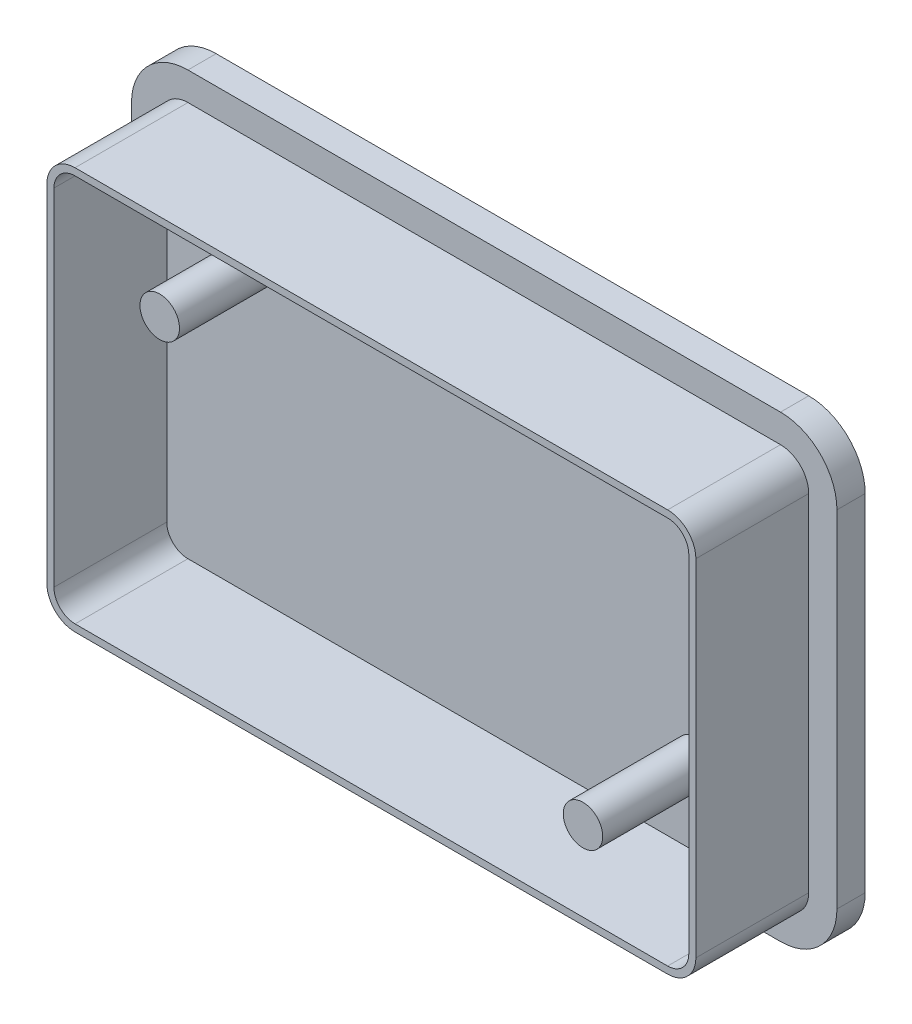
ISO-10303-21;
HEADER;
FILE_DESCRIPTION(('STEP AP214'),'2;1');
FILE_NAME('part.step','',(''),(''),'','','');
FILE_SCHEMA(('AUTOMOTIVE_DESIGN { 1 0 10303 214 1 1 1 1 }'));
ENDSEC;
DATA;
#1=APPLICATION_CONTEXT('core data for automotive mechanical design processes');
#2=APPLICATION_PROTOCOL_DEFINITION('international standard','automotive_design',2000,#1);
#3=PRODUCT_CONTEXT('',#1,'mechanical');
#4=PRODUCT('Part','Part','',(#3));
#5=PRODUCT_RELATED_PRODUCT_CATEGORY('part','',(#4));
#6=PRODUCT_DEFINITION_FORMATION('','',#4);
#7=PRODUCT_DEFINITION_CONTEXT('part definition',#1,'design');
#8=PRODUCT_DEFINITION('design','',#6,#7);
#9=PRODUCT_DEFINITION_SHAPE('','',#8);
#10=(LENGTH_UNIT() NAMED_UNIT(*) SI_UNIT(.MILLI.,.METRE.));
#11=(NAMED_UNIT(*) PLANE_ANGLE_UNIT() SI_UNIT($,.RADIAN.));
#12=(NAMED_UNIT(*) SI_UNIT($,.STERADIAN.) SOLID_ANGLE_UNIT());
#13=UNCERTAINTY_MEASURE_WITH_UNIT(LENGTH_MEASURE(1.E-05),#10,'distance_accuracy_value','');
#14=(GEOMETRIC_REPRESENTATION_CONTEXT(3) GLOBAL_UNCERTAINTY_ASSIGNED_CONTEXT((#13)) GLOBAL_UNIT_ASSIGNED_CONTEXT((#10,
#11,#12)) REPRESENTATION_CONTEXT('',''));
#15=CARTESIAN_POINT('',(0.,0.,0.));
#16=DIRECTION('',(0.,0.,1.));
#17=DIRECTION('',(1.,0.,0.));
#18=AXIS2_PLACEMENT_3D('',#15,#16,#17);
#19=CARTESIAN_POINT('',(-21.,12.25,2.));
#20=DIRECTION('',(0.,0.,-1.));
#21=DIRECTION('',(-1.,0.,0.));
#22=AXIS2_PLACEMENT_3D('',#19,#20,#21);
#23=CYLINDRICAL_SURFACE('',#22,4.);
#24=CARTESIAN_POINT('',(-21.,12.25,0.));
#25=DIRECTION('',(0.,0.,1.));
#26=DIRECTION('',(1.,0.,0.));
#27=AXIS2_PLACEMENT_3D('',#24,#25,#26);
#28=CIRCLE('',#27,4.);
#29=CARTESIAN_POINT('',(-25.,12.25,0.));
#30=VERTEX_POINT('',#29);
#31=CARTESIAN_POINT('',(-21.,16.25,0.));
#32=VERTEX_POINT('',#31);
#33=EDGE_CURVE('E453',#30,#32,#28,.F.);
#34=ORIENTED_EDGE('',*,*,#33,.F.);
#35=DIRECTION('',(0.,0.,-1.));
#36=VECTOR('',#35,1.);
#37=CARTESIAN_POINT('',(-25.,12.25,2.));
#38=LINE('',#37,#36);
#39=CARTESIAN_POINT('',(-25.,12.25,2.));
#40=VERTEX_POINT('',#39);
#41=EDGE_CURVE('E12',#40,#30,#38,.T.);
#42=ORIENTED_EDGE('',*,*,#41,.F.);
#43=CARTESIAN_POINT('',(-21.,12.25,2.));
#44=DIRECTION('',(0.,0.,1.));
#45=DIRECTION('',(1.,0.,0.));
#46=AXIS2_PLACEMENT_3D('',#43,#44,#45);
#47=CIRCLE('',#46,4.);
#48=CARTESIAN_POINT('',(-21.,16.25,2.));
#49=VERTEX_POINT('',#48);
#50=EDGE_CURVE('E454',#40,#49,#47,.F.);
#51=ORIENTED_EDGE('',*,*,#50,.T.);
#52=DIRECTION('',(0.,0.,-1.));
#53=VECTOR('',#52,1.);
#54=CARTESIAN_POINT('',(-21.,16.25,2.));
#55=LINE('',#54,#53);
#56=EDGE_CURVE('E484',#49,#32,#55,.T.);
#57=ORIENTED_EDGE('',*,*,#56,.T.);
#58=EDGE_LOOP('',(#34,#42,#51,#57));
#59=FACE_BOUND('',#58,.T.);
#60=ADVANCED_FACE('F94',(#59),#23,.T.);
#61=CARTESIAN_POINT('',(-25.,0.,2.));
#62=DIRECTION('',(-1.,0.,0.));
#63=DIRECTION('',(0.,0.,1.));
#64=AXIS2_PLACEMENT_3D('',#61,#62,#63);
#65=PLANE('',#64);
#66=DIRECTION('',(0.,1.,0.));
#67=VECTOR('',#66,1.);
#68=CARTESIAN_POINT('',(-25.,0.,0.));
#69=LINE('',#68,#67);
#70=CARTESIAN_POINT('',(-25.,-12.25,0.));
#71=VERTEX_POINT('',#70);
#72=EDGE_CURVE('E488',#71,#30,#69,.T.);
#73=ORIENTED_EDGE('',*,*,#72,.F.);
#74=DIRECTION('',(0.,0.,-1.));
#75=VECTOR('',#74,1.);
#76=CARTESIAN_POINT('',(-25.,-12.25,2.));
#77=LINE('',#76,#75);
#78=CARTESIAN_POINT('',(-25.,-12.25,2.));
#79=VERTEX_POINT('',#78);
#80=EDGE_CURVE('E102',#79,#71,#77,.T.);
#81=ORIENTED_EDGE('',*,*,#80,.F.);
#82=DIRECTION('',(0.,1.,0.));
#83=VECTOR('',#82,1.);
#84=CARTESIAN_POINT('',(-25.,0.,2.));
#85=LINE('',#84,#83);
#86=EDGE_CURVE('E458',#79,#40,#85,.T.);
#87=ORIENTED_EDGE('',*,*,#86,.T.);
#88=ORIENTED_EDGE('',*,*,#41,.T.);
#89=EDGE_LOOP('',(#73,#81,#87,#88));
#90=FACE_BOUND('',#89,.T.);
#91=ADVANCED_FACE('F540',(#90),#65,.T.);
#92=CARTESIAN_POINT('',(-21.,-12.25,2.));
#93=DIRECTION('',(0.,0.,-1.));
#94=DIRECTION('',(-1.,0.,0.));
#95=AXIS2_PLACEMENT_3D('',#92,#93,#94);
#96=CYLINDRICAL_SURFACE('',#95,4.);
#97=CARTESIAN_POINT('',(-21.,-12.25,0.));
#98=DIRECTION('',(0.,0.,1.));
#99=DIRECTION('',(1.,0.,0.));
#100=AXIS2_PLACEMENT_3D('',#97,#98,#99);
#101=CIRCLE('',#100,4.);
#102=CARTESIAN_POINT('',(-21.,-16.25,0.));
#103=VERTEX_POINT('',#102);
#104=EDGE_CURVE('E492',#103,#71,#101,.F.);
#105=ORIENTED_EDGE('',*,*,#104,.F.);
#106=DIRECTION('',(0.,0.,-1.));
#107=VECTOR('',#106,1.);
#108=CARTESIAN_POINT('',(-21.,-16.25,2.));
#109=LINE('',#108,#107);
#110=CARTESIAN_POINT('',(-21.,-16.25,2.));
#111=VERTEX_POINT('',#110);
#112=EDGE_CURVE('E529',#111,#103,#109,.T.);
#113=ORIENTED_EDGE('',*,*,#112,.F.);
#114=CARTESIAN_POINT('',(-21.,-12.25,2.));
#115=DIRECTION('',(0.,0.,1.));
#116=DIRECTION('',(1.,0.,0.));
#117=AXIS2_PLACEMENT_3D('',#114,#115,#116);
#118=CIRCLE('',#117,4.);
#119=EDGE_CURVE('E463',#111,#79,#118,.F.);
#120=ORIENTED_EDGE('',*,*,#119,.T.);
#121=ORIENTED_EDGE('',*,*,#80,.T.);
#122=EDGE_LOOP('',(#105,#113,#120,#121));
#123=FACE_BOUND('',#122,.T.);
#124=ADVANCED_FACE('F536',(#123),#96,.T.);
#125=CARTESIAN_POINT('',(0.,-16.25,2.));
#126=DIRECTION('',(0.,1.,0.));
#127=DIRECTION('',(0.,0.,1.));
#128=AXIS2_PLACEMENT_3D('',#125,#126,#127);
#129=PLANE('',#128);
#130=DIRECTION('',(1.,0.,0.));
#131=VECTOR('',#130,1.);
#132=CARTESIAN_POINT('',(0.,-16.25,0.));
#133=LINE('',#132,#131);
#134=CARTESIAN_POINT('',(21.,-16.25,0.));
#135=VERTEX_POINT('',#134);
#136=EDGE_CURVE('E496',#103,#135,#133,.T.);
#137=ORIENTED_EDGE('',*,*,#136,.T.);
#138=DIRECTION('',(0.,0.,-1.));
#139=VECTOR('',#138,1.);
#140=CARTESIAN_POINT('',(21.,-16.25,2.));
#141=LINE('',#140,#139);
#142=CARTESIAN_POINT('',(21.,-16.25,2.));
#143=VERTEX_POINT('',#142);
#144=EDGE_CURVE('E525',#143,#135,#141,.T.);
#145=ORIENTED_EDGE('',*,*,#144,.F.);
#146=DIRECTION('',(1.,0.,0.));
#147=VECTOR('',#146,1.);
#148=CARTESIAN_POINT('',(0.,-16.25,2.));
#149=LINE('',#148,#147);
#150=EDGE_CURVE('E467',#111,#143,#149,.T.);
#151=ORIENTED_EDGE('',*,*,#150,.F.);
#152=ORIENTED_EDGE('',*,*,#112,.T.);
#153=EDGE_LOOP('',(#137,#145,#151,#152));
#154=FACE_BOUND('',#153,.T.);
#155=ADVANCED_FACE('F549',(#154),#129,.F.);
#156=CARTESIAN_POINT('',(21.,-12.25,2.));
#157=DIRECTION('',(0.,0.,-1.));
#158=DIRECTION('',(-1.,0.,0.));
#159=AXIS2_PLACEMENT_3D('',#156,#157,#158);
#160=CYLINDRICAL_SURFACE('',#159,4.);
#161=CARTESIAN_POINT('',(21.,-12.25,0.));
#162=DIRECTION('',(0.,0.,1.));
#163=DIRECTION('',(1.,0.,0.));
#164=AXIS2_PLACEMENT_3D('',#161,#162,#163);
#165=CIRCLE('',#164,4.);
#166=CARTESIAN_POINT('',(25.,-12.25,0.));
#167=VERTEX_POINT('',#166);
#168=EDGE_CURVE('E499',#135,#167,#165,.T.);
#169=ORIENTED_EDGE('',*,*,#168,.T.);
#170=DIRECTION('',(0.,0.,-1.));
#171=VECTOR('',#170,1.);
#172=CARTESIAN_POINT('',(25.,-12.25,2.));
#173=LINE('',#172,#171);
#174=CARTESIAN_POINT('',(25.,-12.25,2.));
#175=VERTEX_POINT('',#174);
#176=EDGE_CURVE('E521',#175,#167,#173,.T.);
#177=ORIENTED_EDGE('',*,*,#176,.F.);
#178=CARTESIAN_POINT('',(21.,-12.25,2.));
#179=DIRECTION('',(0.,0.,1.));
#180=DIRECTION('',(1.,0.,0.));
#181=AXIS2_PLACEMENT_3D('',#178,#179,#180);
#182=CIRCLE('',#181,4.);
#183=EDGE_CURVE('E470',#143,#175,#182,.T.);
#184=ORIENTED_EDGE('',*,*,#183,.F.);
#185=ORIENTED_EDGE('',*,*,#144,.T.);
#186=EDGE_LOOP('',(#169,#177,#184,#185));
#187=FACE_BOUND('',#186,.T.);
#188=ADVANCED_FACE('F553',(#187),#160,.T.);
#189=CARTESIAN_POINT('',(25.,0.,2.));
#190=DIRECTION('',(-1.,0.,0.));
#191=DIRECTION('',(0.,0.,1.));
#192=AXIS2_PLACEMENT_3D('',#189,#190,#191);
#193=PLANE('',#192);
#194=DIRECTION('',(0.,1.,0.));
#195=VECTOR('',#194,1.);
#196=CARTESIAN_POINT('',(25.,0.,0.));
#197=LINE('',#196,#195);
#198=CARTESIAN_POINT('',(25.,12.25,0.));
#199=VERTEX_POINT('',#198);
#200=EDGE_CURVE('E502',#167,#199,#197,.T.);
#201=ORIENTED_EDGE('',*,*,#200,.T.);
#202=DIRECTION('',(0.,0.,-1.));
#203=VECTOR('',#202,1.);
#204=CARTESIAN_POINT('',(25.,12.25,2.));
#205=LINE('',#204,#203);
#206=CARTESIAN_POINT('',(25.,12.25,2.));
#207=VERTEX_POINT('',#206);
#208=EDGE_CURVE('E518',#207,#199,#205,.T.);
#209=ORIENTED_EDGE('',*,*,#208,.F.);
#210=DIRECTION('',(0.,1.,0.));
#211=VECTOR('',#210,1.);
#212=CARTESIAN_POINT('',(25.,0.,2.));
#213=LINE('',#212,#211);
#214=EDGE_CURVE('E473',#175,#207,#213,.T.);
#215=ORIENTED_EDGE('',*,*,#214,.F.);
#216=ORIENTED_EDGE('',*,*,#176,.T.);
#217=EDGE_LOOP('',(#201,#209,#215,#216));
#218=FACE_BOUND('',#217,.T.);
#219=ADVANCED_FACE('F570',(#218),#193,.F.);
#220=CARTESIAN_POINT('',(21.,12.25,2.));
#221=DIRECTION('',(0.,0.,-1.));
#222=DIRECTION('',(-1.,0.,0.));
#223=AXIS2_PLACEMENT_3D('',#220,#221,#222);
#224=CYLINDRICAL_SURFACE('',#223,4.);
#225=CARTESIAN_POINT('',(21.,12.25,0.));
#226=DIRECTION('',(0.,0.,1.));
#227=DIRECTION('',(1.,0.,0.));
#228=AXIS2_PLACEMENT_3D('',#225,#226,#227);
#229=CIRCLE('',#228,4.);
#230=CARTESIAN_POINT('',(21.,16.25,0.));
#231=VERTEX_POINT('',#230);
#232=EDGE_CURVE('E506',#231,#199,#229,.F.);
#233=ORIENTED_EDGE('',*,*,#232,.F.);
#234=DIRECTION('',(0.,0.,-1.));
#235=VECTOR('',#234,1.);
#236=CARTESIAN_POINT('',(21.,16.25,2.));
#237=LINE('',#236,#235);
#238=CARTESIAN_POINT('',(21.,16.25,2.));
#239=VERTEX_POINT('',#238);
#240=EDGE_CURVE('E515',#239,#231,#237,.T.);
#241=ORIENTED_EDGE('',*,*,#240,.F.);
#242=CARTESIAN_POINT('',(21.,12.25,2.));
#243=DIRECTION('',(0.,0.,1.));
#244=DIRECTION('',(1.,0.,0.));
#245=AXIS2_PLACEMENT_3D('',#242,#243,#244);
#246=CIRCLE('',#245,4.);
#247=EDGE_CURVE('E476',#239,#207,#246,.F.);
#248=ORIENTED_EDGE('',*,*,#247,.T.);
#249=ORIENTED_EDGE('',*,*,#208,.T.);
#250=EDGE_LOOP('',(#233,#241,#248,#249));
#251=FACE_BOUND('',#250,.T.);
#252=ADVANCED_FACE('F568',(#251),#224,.T.);
#253=CARTESIAN_POINT('',(0.,16.25,2.));
#254=DIRECTION('',(0.,1.,0.));
#255=DIRECTION('',(0.,0.,1.));
#256=AXIS2_PLACEMENT_3D('',#253,#254,#255);
#257=PLANE('',#256);
#258=DIRECTION('',(1.,0.,0.));
#259=VECTOR('',#258,1.);
#260=CARTESIAN_POINT('',(0.,16.25,0.));
#261=LINE('',#260,#259);
#262=EDGE_CURVE('E459',#32,#231,#261,.T.);
#263=ORIENTED_EDGE('',*,*,#262,.F.);
#264=ORIENTED_EDGE('',*,*,#56,.F.);
#265=DIRECTION('',(1.,0.,0.));
#266=VECTOR('',#265,1.);
#267=CARTESIAN_POINT('',(0.,16.25,2.));
#268=LINE('',#267,#266);
#269=EDGE_CURVE('E480',#49,#239,#268,.T.);
#270=ORIENTED_EDGE('',*,*,#269,.T.);
#271=ORIENTED_EDGE('',*,*,#240,.T.);
#272=EDGE_LOOP('',(#263,#264,#270,#271));
#273=FACE_BOUND('',#272,.T.);
#274=ADVANCED_FACE('F565',(#273),#257,.T.);
#275=CARTESIAN_POINT('',(0.,0.,2.));
#276=DIRECTION('',(0.,0.,1.));
#277=DIRECTION('',(1.,0.,0.));
#278=AXIS2_PLACEMENT_3D('',#275,#276,#277);
#279=PLANE('',#278);
#280=CARTESIAN_POINT('',(-21.,12.25,2.));
#281=DIRECTION('',(0.,0.,1.));
#282=DIRECTION('',(1.,0.,0.));
#283=AXIS2_PLACEMENT_3D('',#280,#281,#282);
#284=CIRCLE('',#283,2.);
#285=CARTESIAN_POINT('',(-21.,14.25,2.));
#286=VERTEX_POINT('',#285);
#287=CARTESIAN_POINT('',(-23.,12.25,2.));
#288=VERTEX_POINT('',#287);
#289=EDGE_CURVE('E258',#286,#288,#284,.T.);
#290=ORIENTED_EDGE('',*,*,#289,.F.);
#291=DIRECTION('',(-1.,0.,0.));
#292=VECTOR('',#291,1.);
#293=CARTESIAN_POINT('',(0.,14.25,2.));
#294=LINE('',#293,#292);
#295=CARTESIAN_POINT('',(21.,14.25,2.));
#296=VERTEX_POINT('',#295);
#297=EDGE_CURVE('E388',#296,#286,#294,.T.);
#298=ORIENTED_EDGE('',*,*,#297,.F.);
#299=CARTESIAN_POINT('',(21.,12.25,2.));
#300=DIRECTION('',(0.,0.,1.));
#301=DIRECTION('',(1.,0.,0.));
#302=AXIS2_PLACEMENT_3D('',#299,#300,#301);
#303=CIRCLE('',#302,2.);
#304=CARTESIAN_POINT('',(23.,12.25,2.));
#305=VERTEX_POINT('',#304);
#306=EDGE_CURVE('E392',#305,#296,#303,.T.);
#307=ORIENTED_EDGE('',*,*,#306,.F.);
#308=DIRECTION('',(0.,-1.,0.));
#309=VECTOR('',#308,1.);
#310=CARTESIAN_POINT('',(23.,0.,2.));
#311=LINE('',#310,#309);
#312=CARTESIAN_POINT('',(23.,-12.25,2.));
#313=VERTEX_POINT('',#312);
#314=EDGE_CURVE('E396',#305,#313,#311,.T.);
#315=ORIENTED_EDGE('',*,*,#314,.T.);
#316=CARTESIAN_POINT('',(21.,-12.25,2.));
#317=DIRECTION('',(0.,0.,1.));
#318=DIRECTION('',(1.,0.,0.));
#319=AXIS2_PLACEMENT_3D('',#316,#317,#318);
#320=CIRCLE('',#319,2.);
#321=CARTESIAN_POINT('',(21.,-14.25,2.));
#322=VERTEX_POINT('',#321);
#323=EDGE_CURVE('E399',#313,#322,#320,.F.);
#324=ORIENTED_EDGE('',*,*,#323,.T.);
#325=DIRECTION('',(-1.,0.,0.));
#326=VECTOR('',#325,1.);
#327=CARTESIAN_POINT('',(0.,-14.25,2.));
#328=LINE('',#327,#326);
#329=CARTESIAN_POINT('',(-21.,-14.25,2.));
#330=VERTEX_POINT('',#329);
#331=EDGE_CURVE('E402',#322,#330,#328,.T.);
#332=ORIENTED_EDGE('',*,*,#331,.T.);
#333=CARTESIAN_POINT('',(-21.,-12.25,2.));
#334=DIRECTION('',(0.,0.,1.));
#335=DIRECTION('',(1.,0.,0.));
#336=AXIS2_PLACEMENT_3D('',#333,#334,#335);
#337=CIRCLE('',#336,2.);
#338=CARTESIAN_POINT('',(-23.,-12.25,2.));
#339=VERTEX_POINT('',#338);
#340=EDGE_CURVE('E114',#339,#330,#337,.T.);
#341=ORIENTED_EDGE('',*,*,#340,.F.);
#342=DIRECTION('',(0.,-1.,0.));
#343=VECTOR('',#342,1.);
#344=CARTESIAN_POINT('',(-23.,0.,2.));
#345=LINE('',#344,#343);
#346=EDGE_CURVE('E109',#288,#339,#345,.T.);
#347=ORIENTED_EDGE('',*,*,#346,.F.);
#348=EDGE_LOOP('',(#290,#298,#307,#315,#324,#332,#341,#347));
#349=FACE_BOUND('',#348,.T.);
#350=ORIENTED_EDGE('',*,*,#50,.F.);
#351=ORIENTED_EDGE('',*,*,#86,.F.);
#352=ORIENTED_EDGE('',*,*,#119,.F.);
#353=ORIENTED_EDGE('',*,*,#150,.T.);
#354=ORIENTED_EDGE('',*,*,#183,.T.);
#355=ORIENTED_EDGE('',*,*,#214,.T.);
#356=ORIENTED_EDGE('',*,*,#247,.F.);
#357=ORIENTED_EDGE('',*,*,#269,.F.);
#358=EDGE_LOOP('',(#350,#351,#352,#353,#354,#355,#356,#357));
#359=FACE_BOUND('',#358,.T.);
#360=ADVANCED_FACE('F558',(#349,#359),#279,.T.);
#361=CARTESIAN_POINT('',(0.,0.,0.));
#362=DIRECTION('',(0.,0.,1.));
#363=DIRECTION('',(1.,0.,0.));
#364=AXIS2_PLACEMENT_3D('',#361,#362,#363);
#365=PLANE('',#364);
#366=ORIENTED_EDGE('',*,*,#33,.T.);
#367=ORIENTED_EDGE('',*,*,#262,.T.);
#368=ORIENTED_EDGE('',*,*,#232,.T.);
#369=ORIENTED_EDGE('',*,*,#200,.F.);
#370=ORIENTED_EDGE('',*,*,#168,.F.);
#371=ORIENTED_EDGE('',*,*,#136,.F.);
#372=ORIENTED_EDGE('',*,*,#104,.T.);
#373=ORIENTED_EDGE('',*,*,#72,.T.);
#374=EDGE_LOOP('',(#366,#367,#368,#369,#370,#371,#372,#373));
#375=FACE_BOUND('',#374,.T.);
#376=ADVANCED_FACE('F544',(#375),#365,.F.);
#377=CARTESIAN_POINT('',(-22.5,0.,10.));
#378=DIRECTION('',(-1.,0.,0.));
#379=DIRECTION('',(0.,0.,1.));
#380=AXIS2_PLACEMENT_3D('',#377,#378,#379);
#381=PLANE('',#380);
#382=DIRECTION('',(0.,-1.,0.));
#383=VECTOR('',#382,1.);
#384=CARTESIAN_POINT('',(-22.5,0.,2.));
#385=LINE('',#384,#383);
#386=CARTESIAN_POINT('',(-22.5,12.25,2.));
#387=VERTEX_POINT('',#386);
#388=CARTESIAN_POINT('',(-22.5,-12.25,2.));
#389=VERTEX_POINT('',#388);
#390=EDGE_CURVE('E433',#387,#389,#385,.T.);
#391=ORIENTED_EDGE('',*,*,#390,.F.);
#392=DIRECTION('',(0.,0.,-1.));
#393=VECTOR('',#392,1.);
#394=CARTESIAN_POINT('',(-22.5,12.25,10.));
#395=LINE('',#394,#393);
#396=CARTESIAN_POINT('',(-22.5,12.25,10.));
#397=VERTEX_POINT('',#396);
#398=EDGE_CURVE('E356',#397,#387,#395,.T.);
#399=ORIENTED_EDGE('',*,*,#398,.F.);
#400=DIRECTION('',(0.,1.,0.));
#401=VECTOR('',#400,1.);
#402=CARTESIAN_POINT('',(-22.5,0.,10.));
#403=LINE('',#402,#401);
#404=CARTESIAN_POINT('',(-22.5,-12.25,10.));
#405=VERTEX_POINT('',#404);
#406=EDGE_CURVE('E301',#405,#397,#403,.T.);
#407=ORIENTED_EDGE('',*,*,#406,.F.);
#408=DIRECTION('',(0.,0.,-1.));
#409=VECTOR('',#408,1.);
#410=CARTESIAN_POINT('',(-22.5,-12.25,10.));
#411=LINE('',#410,#409);
#412=EDGE_CURVE('E262',#405,#389,#411,.T.);
#413=ORIENTED_EDGE('',*,*,#412,.T.);
#414=EDGE_LOOP('',(#391,#399,#407,#413));
#415=FACE_BOUND('',#414,.T.);
#416=ADVANCED_FACE('F633',(#415),#381,.F.);
#417=CARTESIAN_POINT('',(-21.,12.25,10.));
#418=DIRECTION('',(0.,0.,-1.));
#419=DIRECTION('',(-1.,0.,0.));
#420=AXIS2_PLACEMENT_3D('',#417,#418,#419);
#421=CYLINDRICAL_SURFACE('',#420,1.5);
#422=CARTESIAN_POINT('',(-21.,12.25,2.));
#423=DIRECTION('',(0.,0.,1.));
#424=DIRECTION('',(1.,0.,0.));
#425=AXIS2_PLACEMENT_3D('',#422,#423,#424);
#426=CIRCLE('',#425,1.5);
#427=CARTESIAN_POINT('',(-21.,13.75,2.));
#428=VERTEX_POINT('',#427);
#429=EDGE_CURVE('E429',#428,#387,#426,.T.);
#430=ORIENTED_EDGE('',*,*,#429,.F.);
#431=DIRECTION('',(0.,0.,-1.));
#432=VECTOR('',#431,1.);
#433=CARTESIAN_POINT('',(-21.,13.75,10.));
#434=LINE('',#433,#432);
#435=CARTESIAN_POINT('',(-21.,13.75,10.));
#436=VERTEX_POINT('',#435);
#437=EDGE_CURVE('E352',#436,#428,#434,.T.);
#438=ORIENTED_EDGE('',*,*,#437,.F.);
#439=CARTESIAN_POINT('',(-21.,12.25,10.));
#440=DIRECTION('',(0.,0.,1.));
#441=DIRECTION('',(1.,0.,0.));
#442=AXIS2_PLACEMENT_3D('',#439,#440,#441);
#443=CIRCLE('',#442,1.5);
#444=EDGE_CURVE('E305',#397,#436,#443,.F.);
#445=ORIENTED_EDGE('',*,*,#444,.F.);
#446=ORIENTED_EDGE('',*,*,#398,.T.);
#447=EDGE_LOOP('',(#430,#438,#445,#446));
#448=FACE_BOUND('',#447,.T.);
#449=ADVANCED_FACE('F642',(#448),#421,.F.);
#450=CARTESIAN_POINT('',(0.,13.75,10.));
#451=DIRECTION('',(0.,1.,0.));
#452=DIRECTION('',(0.,0.,1.));
#453=AXIS2_PLACEMENT_3D('',#450,#451,#452);
#454=PLANE('',#453);
#455=DIRECTION('',(-1.,0.,0.));
#456=VECTOR('',#455,1.);
#457=CARTESIAN_POINT('',(0.,13.75,2.));
#458=LINE('',#457,#456);
#459=CARTESIAN_POINT('',(21.,13.75,2.));
#460=VERTEX_POINT('',#459);
#461=EDGE_CURVE('E425',#460,#428,#458,.T.);
#462=ORIENTED_EDGE('',*,*,#461,.F.);
#463=DIRECTION('',(0.,0.,-1.));
#464=VECTOR('',#463,1.);
#465=CARTESIAN_POINT('',(21.,13.75,10.));
#466=LINE('',#465,#464);
#467=CARTESIAN_POINT('',(21.,13.75,10.));
#468=VERTEX_POINT('',#467);
#469=EDGE_CURVE('E348',#468,#460,#466,.T.);
#470=ORIENTED_EDGE('',*,*,#469,.F.);
#471=DIRECTION('',(1.,0.,0.));
#472=VECTOR('',#471,1.);
#473=CARTESIAN_POINT('',(0.,13.75,10.));
#474=LINE('',#473,#472);
#475=EDGE_CURVE('E308',#436,#468,#474,.T.);
#476=ORIENTED_EDGE('',*,*,#475,.F.);
#477=ORIENTED_EDGE('',*,*,#437,.T.);
#478=EDGE_LOOP('',(#462,#470,#476,#477));
#479=FACE_BOUND('',#478,.T.);
#480=ADVANCED_FACE('F652',(#479),#454,.F.);
#481=CARTESIAN_POINT('',(21.,12.25,10.));
#482=DIRECTION('',(0.,0.,-1.));
#483=DIRECTION('',(-1.,0.,0.));
#484=AXIS2_PLACEMENT_3D('',#481,#482,#483);
#485=CYLINDRICAL_SURFACE('',#484,1.5);
#486=CARTESIAN_POINT('',(21.,12.25,2.));
#487=DIRECTION('',(0.,0.,1.));
#488=DIRECTION('',(1.,0.,0.));
#489=AXIS2_PLACEMENT_3D('',#486,#487,#488);
#490=CIRCLE('',#489,1.5);
#491=CARTESIAN_POINT('',(22.5,12.25,2.));
#492=VERTEX_POINT('',#491);
#493=EDGE_CURVE('E421',#492,#460,#490,.T.);
#494=ORIENTED_EDGE('',*,*,#493,.F.);
#495=DIRECTION('',(0.,0.,-1.));
#496=VECTOR('',#495,1.);
#497=CARTESIAN_POINT('',(22.5,12.25,10.));
#498=LINE('',#497,#496);
#499=CARTESIAN_POINT('',(22.5,12.25,10.));
#500=VERTEX_POINT('',#499);
#501=EDGE_CURVE('E344',#500,#492,#498,.T.);
#502=ORIENTED_EDGE('',*,*,#501,.F.);
#503=CARTESIAN_POINT('',(21.,12.25,10.));
#504=DIRECTION('',(0.,0.,1.));
#505=DIRECTION('',(1.,0.,0.));
#506=AXIS2_PLACEMENT_3D('',#503,#504,#505);
#507=CIRCLE('',#506,1.5);
#508=EDGE_CURVE('E311',#468,#500,#507,.F.);
#509=ORIENTED_EDGE('',*,*,#508,.F.);
#510=ORIENTED_EDGE('',*,*,#469,.T.);
#511=EDGE_LOOP('',(#494,#502,#509,#510));
#512=FACE_BOUND('',#511,.T.);
#513=ADVANCED_FACE('F662',(#512),#485,.F.);
#514=CARTESIAN_POINT('',(22.5,0.,10.));
#515=DIRECTION('',(-1.,0.,0.));
#516=DIRECTION('',(0.,0.,1.));
#517=AXIS2_PLACEMENT_3D('',#514,#515,#516);
#518=PLANE('',#517);
#519=ORIENTED_EDGE('',*,*,#501,.T.);
#520=DIRECTION('',(0.,-1.,0.));
#521=VECTOR('',#520,1.);
#522=CARTESIAN_POINT('',(22.5,0.,2.));
#523=LINE('',#522,#521);
#524=CARTESIAN_POINT('',(22.5,-12.25,2.));
#525=VERTEX_POINT('',#524);
#526=EDGE_CURVE('E418',#492,#525,#523,.T.);
#527=ORIENTED_EDGE('',*,*,#526,.T.);
#528=DIRECTION('',(0.,0.,-1.));
#529=VECTOR('',#528,1.);
#530=CARTESIAN_POINT('',(22.5,-12.25,10.));
#531=LINE('',#530,#529);
#532=CARTESIAN_POINT('',(22.5,-12.25,10.));
#533=VERTEX_POINT('',#532);
#534=EDGE_CURVE('E340',#533,#525,#531,.T.);
#535=ORIENTED_EDGE('',*,*,#534,.F.);
#536=DIRECTION('',(0.,1.,0.));
#537=VECTOR('',#536,1.);
#538=CARTESIAN_POINT('',(22.5,0.,10.));
#539=LINE('',#538,#537);
#540=EDGE_CURVE('E314',#533,#500,#539,.T.);
#541=ORIENTED_EDGE('',*,*,#540,.T.);
#542=EDGE_LOOP('',(#519,#527,#535,#541));
#543=FACE_BOUND('',#542,.T.);
#544=ADVANCED_FACE('F672',(#543),#518,.T.);
#545=CARTESIAN_POINT('',(21.,-12.25,10.));
#546=DIRECTION('',(0.,0.,-1.));
#547=DIRECTION('',(-1.,0.,0.));
#548=AXIS2_PLACEMENT_3D('',#545,#546,#547);
#549=CYLINDRICAL_SURFACE('',#548,1.5);
#550=ORIENTED_EDGE('',*,*,#534,.T.);
#551=CARTESIAN_POINT('',(21.,-12.25,2.));
#552=DIRECTION('',(0.,0.,1.));
#553=DIRECTION('',(1.,0.,0.));
#554=AXIS2_PLACEMENT_3D('',#551,#552,#553);
#555=CIRCLE('',#554,1.5);
#556=CARTESIAN_POINT('',(21.,-13.75,2.));
#557=VERTEX_POINT('',#556);
#558=EDGE_CURVE('E415',#525,#557,#555,.F.);
#559=ORIENTED_EDGE('',*,*,#558,.T.);
#560=DIRECTION('',(0.,0.,-1.));
#561=VECTOR('',#560,1.);
#562=CARTESIAN_POINT('',(21.,-13.75,10.));
#563=LINE('',#562,#561);
#564=CARTESIAN_POINT('',(21.,-13.75,10.));
#565=VERTEX_POINT('',#564);
#566=EDGE_CURVE('E336',#565,#557,#563,.T.);
#567=ORIENTED_EDGE('',*,*,#566,.F.);
#568=CARTESIAN_POINT('',(21.,-12.25,10.));
#569=DIRECTION('',(0.,0.,1.));
#570=DIRECTION('',(1.,0.,0.));
#571=AXIS2_PLACEMENT_3D('',#568,#569,#570);
#572=CIRCLE('',#571,1.5);
#573=EDGE_CURVE('E318',#565,#533,#572,.T.);
#574=ORIENTED_EDGE('',*,*,#573,.T.);
#575=EDGE_LOOP('',(#550,#559,#567,#574));
#576=FACE_BOUND('',#575,.T.);
#577=ADVANCED_FACE('F682',(#576),#549,.F.);
#578=CARTESIAN_POINT('',(0.,-13.75,10.));
#579=DIRECTION('',(0.,1.,0.));
#580=DIRECTION('',(0.,0.,1.));
#581=AXIS2_PLACEMENT_3D('',#578,#579,#580);
#582=PLANE('',#581);
#583=ORIENTED_EDGE('',*,*,#566,.T.);
#584=DIRECTION('',(-1.,0.,0.));
#585=VECTOR('',#584,1.);
#586=CARTESIAN_POINT('',(0.,-13.75,2.));
#587=LINE('',#586,#585);
#588=CARTESIAN_POINT('',(-21.,-13.75,2.));
#589=VERTEX_POINT('',#588);
#590=EDGE_CURVE('E411',#557,#589,#587,.T.);
#591=ORIENTED_EDGE('',*,*,#590,.T.);
#592=DIRECTION('',(0.,0.,-1.));
#593=VECTOR('',#592,1.);
#594=CARTESIAN_POINT('',(-21.,-13.75,10.));
#595=LINE('',#594,#593);
#596=CARTESIAN_POINT('',(-21.,-13.75,10.));
#597=VERTEX_POINT('',#596);
#598=EDGE_CURVE('E333',#597,#589,#595,.T.);
#599=ORIENTED_EDGE('',*,*,#598,.F.);
#600=DIRECTION('',(1.,0.,0.));
#601=VECTOR('',#600,1.);
#602=CARTESIAN_POINT('',(0.,-13.75,10.));
#603=LINE('',#602,#601);
#604=EDGE_CURVE('E322',#597,#565,#603,.T.);
#605=ORIENTED_EDGE('',*,*,#604,.T.);
#606=EDGE_LOOP('',(#583,#591,#599,#605));
#607=FACE_BOUND('',#606,.T.);
#608=ADVANCED_FACE('F692',(#607),#582,.T.);
#609=CARTESIAN_POINT('',(-21.,12.25,10.));
#610=DIRECTION('',(0.,0.,-1.));
#611=DIRECTION('',(-1.,0.,0.));
#612=AXIS2_PLACEMENT_3D('',#609,#610,#611);
#613=CYLINDRICAL_SURFACE('',#612,2.);
#614=DIRECTION('',(0.,0.,-1.));
#615=VECTOR('',#614,1.);
#616=CARTESIAN_POINT('',(-21.,14.25,10.));
#617=LINE('',#616,#615);
#618=CARTESIAN_POINT('',(-21.,14.25,10.));
#619=VERTEX_POINT('',#618);
#620=EDGE_CURVE('E329',#619,#286,#617,.T.);
#621=ORIENTED_EDGE('',*,*,#620,.T.);
#622=ORIENTED_EDGE('',*,*,#289,.T.);
#623=DIRECTION('',(0.,0.,-1.));
#624=VECTOR('',#623,1.);
#625=CARTESIAN_POINT('',(-23.,12.25,10.));
#626=LINE('',#625,#624);
#627=CARTESIAN_POINT('',(-23.,12.25,10.));
#628=VERTEX_POINT('',#627);
#629=EDGE_CURVE('E252',#628,#288,#626,.T.);
#630=ORIENTED_EDGE('',*,*,#629,.F.);
#631=CARTESIAN_POINT('',(-21.,12.25,10.));
#632=DIRECTION('',(0.,0.,1.));
#633=DIRECTION('',(1.,0.,0.));
#634=AXIS2_PLACEMENT_3D('',#631,#632,#633);
#635=CIRCLE('',#634,2.);
#636=EDGE_CURVE('E256',#628,#619,#635,.F.);
#637=ORIENTED_EDGE('',*,*,#636,.T.);
#638=EDGE_LOOP('',(#621,#622,#630,#637));
#639=FACE_BOUND('',#638,.T.);
#640=ADVANCED_FACE('F255',(#639),#613,.T.);
#641=CARTESIAN_POINT('',(-23.,0.,10.));
#642=DIRECTION('',(-1.,0.,0.));
#643=DIRECTION('',(0.,0.,1.));
#644=AXIS2_PLACEMENT_3D('',#641,#642,#643);
#645=PLANE('',#644);
#646=ORIENTED_EDGE('',*,*,#629,.T.);
#647=ORIENTED_EDGE('',*,*,#346,.T.);
#648=DIRECTION('',(0.,0.,-1.));
#649=VECTOR('',#648,1.);
#650=CARTESIAN_POINT('',(-23.,-12.25,10.));
#651=LINE('',#650,#649);
#652=CARTESIAN_POINT('',(-23.,-12.25,10.));
#653=VERTEX_POINT('',#652);
#654=EDGE_CURVE('E263',#653,#339,#651,.T.);
#655=ORIENTED_EDGE('',*,*,#654,.F.);
#656=DIRECTION('',(0.,1.,0.));
#657=VECTOR('',#656,1.);
#658=CARTESIAN_POINT('',(-23.,0.,10.));
#659=LINE('',#658,#657);
#660=EDGE_CURVE('E270',#653,#628,#659,.T.);
#661=ORIENTED_EDGE('',*,*,#660,.T.);
#662=EDGE_LOOP('',(#646,#647,#655,#661));
#663=FACE_BOUND('',#662,.T.);
#664=ADVANCED_FACE('F277',(#663),#645,.T.);
#665=CARTESIAN_POINT('',(-21.,-12.25,10.));
#666=DIRECTION('',(0.,0.,-1.));
#667=DIRECTION('',(-1.,0.,0.));
#668=AXIS2_PLACEMENT_3D('',#665,#666,#667);
#669=CYLINDRICAL_SURFACE('',#668,2.);
#670=ORIENTED_EDGE('',*,*,#654,.T.);
#671=ORIENTED_EDGE('',*,*,#340,.T.);
#672=DIRECTION('',(0.,0.,-1.));
#673=VECTOR('',#672,1.);
#674=CARTESIAN_POINT('',(-21.,-14.25,10.));
#675=LINE('',#674,#673);
#676=CARTESIAN_POINT('',(-21.,-14.25,10.));
#677=VERTEX_POINT('',#676);
#678=EDGE_CURVE('E379',#677,#330,#675,.T.);
#679=ORIENTED_EDGE('',*,*,#678,.F.);
#680=CARTESIAN_POINT('',(-21.,-12.25,10.));
#681=DIRECTION('',(0.,0.,1.));
#682=DIRECTION('',(1.,0.,0.));
#683=AXIS2_PLACEMENT_3D('',#680,#681,#682);
#684=CIRCLE('',#683,2.);
#685=EDGE_CURVE('E280',#677,#653,#684,.F.);
#686=ORIENTED_EDGE('',*,*,#685,.T.);
#687=EDGE_LOOP('',(#670,#671,#679,#686));
#688=FACE_BOUND('',#687,.T.);
#689=ADVANCED_FACE('F719',(#688),#669,.T.);
#690=CARTESIAN_POINT('',(0.,-14.25,10.));
#691=DIRECTION('',(0.,1.,0.));
#692=DIRECTION('',(0.,0.,1.));
#693=AXIS2_PLACEMENT_3D('',#690,#691,#692);
#694=PLANE('',#693);
#695=ORIENTED_EDGE('',*,*,#331,.F.);
#696=DIRECTION('',(0.,0.,-1.));
#697=VECTOR('',#696,1.);
#698=CARTESIAN_POINT('',(21.,-14.25,10.));
#699=LINE('',#698,#697);
#700=CARTESIAN_POINT('',(21.,-14.25,10.));
#701=VERTEX_POINT('',#700);
#702=EDGE_CURVE('E375',#701,#322,#699,.T.);
#703=ORIENTED_EDGE('',*,*,#702,.F.);
#704=DIRECTION('',(1.,0.,0.));
#705=VECTOR('',#704,1.);
#706=CARTESIAN_POINT('',(0.,-14.25,10.));
#707=LINE('',#706,#705);
#708=EDGE_CURVE('E284',#677,#701,#707,.T.);
#709=ORIENTED_EDGE('',*,*,#708,.F.);
#710=ORIENTED_EDGE('',*,*,#678,.T.);
#711=EDGE_LOOP('',(#695,#703,#709,#710));
#712=FACE_BOUND('',#711,.T.);
#713=ADVANCED_FACE('F728',(#712),#694,.F.);
#714=CARTESIAN_POINT('',(21.,-12.25,10.));
#715=DIRECTION('',(0.,0.,-1.));
#716=DIRECTION('',(-1.,0.,0.));
#717=AXIS2_PLACEMENT_3D('',#714,#715,#716);
#718=CYLINDRICAL_SURFACE('',#717,2.);
#719=ORIENTED_EDGE('',*,*,#323,.F.);
#720=DIRECTION('',(0.,0.,-1.));
#721=VECTOR('',#720,1.);
#722=CARTESIAN_POINT('',(23.,-12.25,10.));
#723=LINE('',#722,#721);
#724=CARTESIAN_POINT('',(23.,-12.25,10.));
#725=VERTEX_POINT('',#724);
#726=EDGE_CURVE('E371',#725,#313,#723,.T.);
#727=ORIENTED_EDGE('',*,*,#726,.F.);
#728=CARTESIAN_POINT('',(21.,-12.25,10.));
#729=DIRECTION('',(0.,0.,1.));
#730=DIRECTION('',(1.,0.,0.));
#731=AXIS2_PLACEMENT_3D('',#728,#729,#730);
#732=CIRCLE('',#731,2.);
#733=EDGE_CURVE('E289',#701,#725,#732,.T.);
#734=ORIENTED_EDGE('',*,*,#733,.F.);
#735=ORIENTED_EDGE('',*,*,#702,.T.);
#736=EDGE_LOOP('',(#719,#727,#734,#735));
#737=FACE_BOUND('',#736,.T.);
#738=ADVANCED_FACE('F738',(#737),#718,.T.);
#739=CARTESIAN_POINT('',(23.,0.,10.));
#740=DIRECTION('',(-1.,0.,0.));
#741=DIRECTION('',(0.,0.,1.));
#742=AXIS2_PLACEMENT_3D('',#739,#740,#741);
#743=PLANE('',#742);
#744=ORIENTED_EDGE('',*,*,#314,.F.);
#745=DIRECTION('',(0.,0.,-1.));
#746=VECTOR('',#745,1.);
#747=CARTESIAN_POINT('',(23.,12.25,10.));
#748=LINE('',#747,#746);
#749=CARTESIAN_POINT('',(23.,12.25,10.));
#750=VERTEX_POINT('',#749);
#751=EDGE_CURVE('E367',#750,#305,#748,.T.);
#752=ORIENTED_EDGE('',*,*,#751,.F.);
#753=DIRECTION('',(0.,1.,0.));
#754=VECTOR('',#753,1.);
#755=CARTESIAN_POINT('',(23.,0.,10.));
#756=LINE('',#755,#754);
#757=EDGE_CURVE('E292',#725,#750,#756,.T.);
#758=ORIENTED_EDGE('',*,*,#757,.F.);
#759=ORIENTED_EDGE('',*,*,#726,.T.);
#760=EDGE_LOOP('',(#744,#752,#758,#759));
#761=FACE_BOUND('',#760,.T.);
#762=ADVANCED_FACE('F748',(#761),#743,.F.);
#763=CARTESIAN_POINT('',(21.,12.25,10.));
#764=DIRECTION('',(0.,0.,-1.));
#765=DIRECTION('',(-1.,0.,0.));
#766=AXIS2_PLACEMENT_3D('',#763,#764,#765);
#767=CYLINDRICAL_SURFACE('',#766,2.);
#768=ORIENTED_EDGE('',*,*,#751,.T.);
#769=ORIENTED_EDGE('',*,*,#306,.T.);
#770=DIRECTION('',(0.,0.,-1.));
#771=VECTOR('',#770,1.);
#772=CARTESIAN_POINT('',(21.,14.25,10.));
#773=LINE('',#772,#771);
#774=CARTESIAN_POINT('',(21.,14.25,10.));
#775=VERTEX_POINT('',#774);
#776=EDGE_CURVE('E363',#775,#296,#773,.T.);
#777=ORIENTED_EDGE('',*,*,#776,.F.);
#778=CARTESIAN_POINT('',(21.,12.25,10.));
#779=DIRECTION('',(0.,0.,1.));
#780=DIRECTION('',(1.,0.,0.));
#781=AXIS2_PLACEMENT_3D('',#778,#779,#780);
#782=CIRCLE('',#781,2.);
#783=EDGE_CURVE('E295',#775,#750,#782,.F.);
#784=ORIENTED_EDGE('',*,*,#783,.T.);
#785=EDGE_LOOP('',(#768,#769,#777,#784));
#786=FACE_BOUND('',#785,.T.);
#787=ADVANCED_FACE('F758',(#786),#767,.T.);
#788=CARTESIAN_POINT('',(0.,14.25,10.));
#789=DIRECTION('',(0.,1.,0.));
#790=DIRECTION('',(0.,0.,1.));
#791=AXIS2_PLACEMENT_3D('',#788,#789,#790);
#792=PLANE('',#791);
#793=ORIENTED_EDGE('',*,*,#776,.T.);
#794=ORIENTED_EDGE('',*,*,#297,.T.);
#795=ORIENTED_EDGE('',*,*,#620,.F.);
#796=DIRECTION('',(1.,0.,0.));
#797=VECTOR('',#796,1.);
#798=CARTESIAN_POINT('',(0.,14.25,10.));
#799=LINE('',#798,#797);
#800=EDGE_CURVE('E274',#619,#775,#799,.T.);
#801=ORIENTED_EDGE('',*,*,#800,.T.);
#802=EDGE_LOOP('',(#793,#794,#795,#801));
#803=FACE_BOUND('',#802,.T.);
#804=ADVANCED_FACE('F768',(#803),#792,.T.);
#805=CARTESIAN_POINT('',(-21.,-12.25,10.));
#806=DIRECTION('',(0.,0.,-1.));
#807=DIRECTION('',(-1.,0.,0.));
#808=AXIS2_PLACEMENT_3D('',#805,#806,#807);
#809=CYLINDRICAL_SURFACE('',#808,1.5);
#810=CARTESIAN_POINT('',(-21.,-12.25,2.));
#811=DIRECTION('',(0.,0.,1.));
#812=DIRECTION('',(1.,0.,0.));
#813=AXIS2_PLACEMENT_3D('',#810,#811,#812);
#814=CIRCLE('',#813,1.5);
#815=EDGE_CURVE('E360',#389,#589,#814,.T.);
#816=ORIENTED_EDGE('',*,*,#815,.F.);
#817=ORIENTED_EDGE('',*,*,#412,.F.);
#818=CARTESIAN_POINT('',(-21.,-12.25,10.));
#819=DIRECTION('',(0.,0.,1.));
#820=DIRECTION('',(1.,0.,0.));
#821=AXIS2_PLACEMENT_3D('',#818,#819,#820);
#822=CIRCLE('',#821,1.5);
#823=EDGE_CURVE('E326',#597,#405,#822,.F.);
#824=ORIENTED_EDGE('',*,*,#823,.F.);
#825=ORIENTED_EDGE('',*,*,#598,.T.);
#826=EDGE_LOOP('',(#816,#817,#824,#825));
#827=FACE_BOUND('',#826,.T.);
#828=ADVANCED_FACE('F778',(#827),#809,.F.);
#829=CARTESIAN_POINT('',(0.,0.,10.));
#830=DIRECTION('',(0.,0.,1.));
#831=DIRECTION('',(1.,0.,0.));
#832=AXIS2_PLACEMENT_3D('',#829,#830,#831);
#833=PLANE('',#832);
#834=ORIENTED_EDGE('',*,*,#636,.F.);
#835=ORIENTED_EDGE('',*,*,#660,.F.);
#836=ORIENTED_EDGE('',*,*,#685,.F.);
#837=ORIENTED_EDGE('',*,*,#708,.T.);
#838=ORIENTED_EDGE('',*,*,#733,.T.);
#839=ORIENTED_EDGE('',*,*,#757,.T.);
#840=ORIENTED_EDGE('',*,*,#783,.F.);
#841=ORIENTED_EDGE('',*,*,#800,.F.);
#842=EDGE_LOOP('',(#834,#835,#836,#837,#838,#839,#840,#841));
#843=FACE_BOUND('',#842,.T.);
#844=ORIENTED_EDGE('',*,*,#406,.T.);
#845=ORIENTED_EDGE('',*,*,#444,.T.);
#846=ORIENTED_EDGE('',*,*,#475,.T.);
#847=ORIENTED_EDGE('',*,*,#508,.T.);
#848=ORIENTED_EDGE('',*,*,#540,.F.);
#849=ORIENTED_EDGE('',*,*,#573,.F.);
#850=ORIENTED_EDGE('',*,*,#604,.F.);
#851=ORIENTED_EDGE('',*,*,#823,.T.);
#852=EDGE_LOOP('',(#844,#845,#846,#847,#848,#849,#850,#851));
#853=FACE_BOUND('',#852,.T.);
#854=ADVANCED_FACE('F267',(#843,#853),#833,.T.);
#855=CARTESIAN_POINT('',(0.,0.,10.));
#856=DIRECTION('',(0.,0.,1.));
#857=DIRECTION('',(1.,0.,0.));
#858=AXIS2_PLACEMENT_3D('',#855,#856,#857);
#859=PLANE('',#858);
#860=CARTESIAN_POINT('',(15.,-8.1,10.));
#861=DIRECTION('',(0.,0.,1.));
#862=DIRECTION('',(1.,0.,0.));
#863=AXIS2_PLACEMENT_3D('',#860,#861,#862);
#864=CIRCLE('',#863,1.4);
#865=CARTESIAN_POINT('',(16.4,-8.1,10.));
#866=VERTEX_POINT('',#865);
#867=EDGE_CURVE('E437',#866,#866,#864,.T.);
#868=ORIENTED_EDGE('',*,*,#867,.T.);
#869=EDGE_LOOP('',(#868));
#870=FACE_BOUND('',#869,.T.);
#871=ADVANCED_FACE('F797',(#870),#859,.T.);
#872=CARTESIAN_POINT('',(0.,0.,10.));
#873=DIRECTION('',(0.,0.,1.));
#874=DIRECTION('',(1.,0.,0.));
#875=AXIS2_PLACEMENT_3D('',#872,#873,#874);
#876=PLANE('',#875);
#877=CARTESIAN_POINT('',(-15.,8.1,10.));
#878=DIRECTION('',(0.,0.,1.));
#879=DIRECTION('',(1.,0.,0.));
#880=AXIS2_PLACEMENT_3D('',#877,#878,#879);
#881=CIRCLE('',#880,1.4);
#882=CARTESIAN_POINT('',(-13.6,8.1,10.));
#883=VERTEX_POINT('',#882);
#884=EDGE_CURVE('E445',#883,#883,#881,.T.);
#885=ORIENTED_EDGE('',*,*,#884,.T.);
#886=EDGE_LOOP('',(#885));
#887=FACE_BOUND('',#886,.T.);
#888=ADVANCED_FACE('F806',(#887),#876,.T.);
#889=CARTESIAN_POINT('',(15.,-8.1,10.));
#890=DIRECTION('',(0.,0.,-1.));
#891=DIRECTION('',(-1.,0.,0.));
#892=AXIS2_PLACEMENT_3D('',#889,#890,#891);
#893=CYLINDRICAL_SURFACE('',#892,1.4);
#894=CARTESIAN_POINT('',(15.,-8.1,2.));
#895=DIRECTION('',(0.,0.,1.));
#896=DIRECTION('',(1.,0.,0.));
#897=AXIS2_PLACEMENT_3D('',#894,#895,#896);
#898=CIRCLE('',#897,1.4);
#899=CARTESIAN_POINT('',(16.4,-8.1,2.));
#900=VERTEX_POINT('',#899);
#901=EDGE_CURVE('E441',#900,#900,#898,.F.);
#902=ORIENTED_EDGE('',*,*,#901,.F.);
#903=EDGE_LOOP('',(#902));
#904=FACE_BOUND('',#903,.T.);
#905=ORIENTED_EDGE('',*,*,#867,.F.);
#906=EDGE_LOOP('',(#905));
#907=FACE_BOUND('',#906,.T.);
#908=ADVANCED_FACE('F816',(#904,#907),#893,.T.);
#909=CARTESIAN_POINT('',(-15.,8.1,10.));
#910=DIRECTION('',(0.,0.,-1.));
#911=DIRECTION('',(-1.,0.,0.));
#912=AXIS2_PLACEMENT_3D('',#909,#910,#911);
#913=CYLINDRICAL_SURFACE('',#912,1.4);
#914=CARTESIAN_POINT('',(-15.,8.1,2.));
#915=DIRECTION('',(0.,0.,1.));
#916=DIRECTION('',(1.,0.,0.));
#917=AXIS2_PLACEMENT_3D('',#914,#915,#916);
#918=CIRCLE('',#917,1.4);
#919=CARTESIAN_POINT('',(-13.6,8.1,2.));
#920=VERTEX_POINT('',#919);
#921=EDGE_CURVE('E449',#920,#920,#918,.F.);
#922=ORIENTED_EDGE('',*,*,#921,.F.);
#923=EDGE_LOOP('',(#922));
#924=FACE_BOUND('',#923,.T.);
#925=ORIENTED_EDGE('',*,*,#884,.F.);
#926=EDGE_LOOP('',(#925));
#927=FACE_BOUND('',#926,.T.);
#928=ADVANCED_FACE('F826',(#924,#927),#913,.T.);
#929=ORIENTED_EDGE('',*,*,#921,.T.);
#930=EDGE_LOOP('',(#929));
#931=FACE_BOUND('',#930,.T.);
#932=ORIENTED_EDGE('',*,*,#901,.T.);
#933=EDGE_LOOP('',(#932));
#934=FACE_BOUND('',#933,.T.);
#935=ORIENTED_EDGE('',*,*,#429,.T.);
#936=ORIENTED_EDGE('',*,*,#390,.T.);
#937=ORIENTED_EDGE('',*,*,#815,.T.);
#938=ORIENTED_EDGE('',*,*,#590,.F.);
#939=ORIENTED_EDGE('',*,*,#558,.F.);
#940=ORIENTED_EDGE('',*,*,#526,.F.);
#941=ORIENTED_EDGE('',*,*,#493,.T.);
#942=ORIENTED_EDGE('',*,*,#461,.T.);
#943=EDGE_LOOP('',(#935,#936,#937,#938,#939,#940,#941,#942));
#944=FACE_BOUND('',#943,.T.);
#945=ADVANCED_FACE('F625',(#931,#934,#944),#279,.T.);
#946=CLOSED_SHELL('',(#60,#91,#124,#155,#188,#219,#252,#274,#360,#376,#416,#449,#480,#513,#544,
#577,#608,#640,#664,#689,#713,#738,#762,#787,#804,#828,#854,#871,#888,#908,#928,#945));
#947=MANIFOLD_SOLID_BREP('B2',#946);
#948=ADVANCED_BREP_SHAPE_REPRESENTATION('',(#18,#947),#14);
#949=SHAPE_DEFINITION_REPRESENTATION(#9,#948);
ENDSEC;
END-ISO-10303-21;
